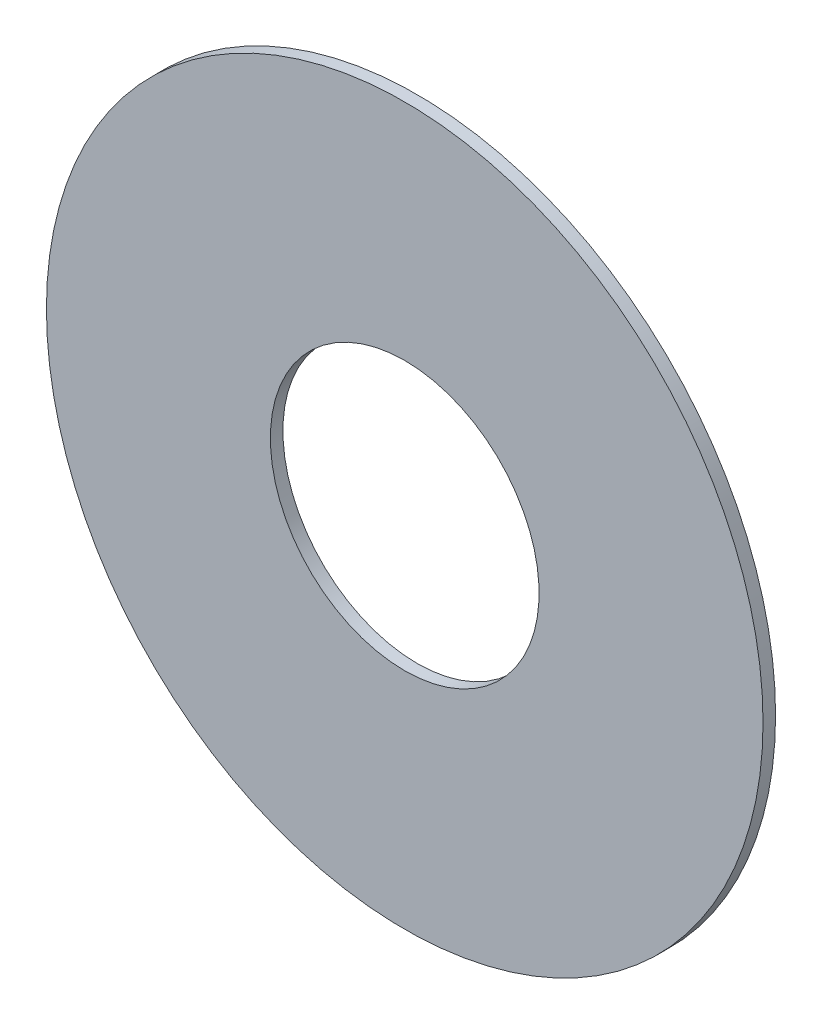
ISO-10303-21;
HEADER;
FILE_DESCRIPTION(('STEP AP214'),'2;1');
FILE_NAME('part.step','',(''),(''),'','','');
FILE_SCHEMA(('AUTOMOTIVE_DESIGN { 1 0 10303 214 1 1 1 1 }'));
ENDSEC;
DATA;
#1=APPLICATION_CONTEXT('core data for automotive mechanical design processes');
#2=APPLICATION_PROTOCOL_DEFINITION('international standard','automotive_design',2000,#1);
#3=PRODUCT_CONTEXT('',#1,'mechanical');
#4=PRODUCT('Part','Part','',(#3));
#5=PRODUCT_RELATED_PRODUCT_CATEGORY('part','',(#4));
#6=PRODUCT_DEFINITION_FORMATION('','',#4);
#7=PRODUCT_DEFINITION_CONTEXT('part definition',#1,'design');
#8=PRODUCT_DEFINITION('design','',#6,#7);
#9=PRODUCT_DEFINITION_SHAPE('','',#8);
#10=(LENGTH_UNIT() NAMED_UNIT(*) SI_UNIT(.MILLI.,.METRE.));
#11=(NAMED_UNIT(*) PLANE_ANGLE_UNIT() SI_UNIT($,.RADIAN.));
#12=(NAMED_UNIT(*) SI_UNIT($,.STERADIAN.) SOLID_ANGLE_UNIT());
#13=UNCERTAINTY_MEASURE_WITH_UNIT(LENGTH_MEASURE(1.E-05),#10,'distance_accuracy_value','');
#14=(GEOMETRIC_REPRESENTATION_CONTEXT(3) GLOBAL_UNCERTAINTY_ASSIGNED_CONTEXT((#13)) GLOBAL_UNIT_ASSIGNED_CONTEXT((#10,
#11,#12)) REPRESENTATION_CONTEXT('',''));
#15=CARTESIAN_POINT('',(0.,0.,0.));
#16=DIRECTION('',(0.,0.,1.));
#17=DIRECTION('',(1.,0.,0.));
#18=AXIS2_PLACEMENT_3D('',#15,#16,#17);
#19=CARTESIAN_POINT('',(148.844,-73.152,-0.045));
#20=DIRECTION('',(0.,0.,-1.));
#21=DIRECTION('',(0.,-1.,0.));
#22=AXIS2_PLACEMENT_3D('',#19,#20,#21);
#23=CYLINDRICAL_SURFACE('',#22,0.375);
#24=CARTESIAN_POINT('',(148.844,-73.152,-0.035));
#25=DIRECTION('',(0.,0.,-1.));
#26=DIRECTION('',(0.,-1.,0.));
#27=AXIS2_PLACEMENT_3D('',#24,#25,#26);
#28=CIRCLE('',#27,0.375);
#29=CARTESIAN_POINT('',(148.844,-73.527,-0.035));
#30=VERTEX_POINT('',#29);
#31=EDGE_CURVE('E25',#30,#30,#28,.T.);
#32=ORIENTED_EDGE('',*,*,#31,.T.);
#33=DIRECTION('',(0.,0.,1.));
#34=VECTOR('',#33,1.);
#35=CARTESIAN_POINT('',(148.844,-73.527,-0.045));
#36=LINE('',#35,#34);
#37=CARTESIAN_POINT('',(148.844,-73.527,0.));
#38=VERTEX_POINT('',#37);
#39=EDGE_CURVE('E11',#30,#38,#36,.T.);
#40=ORIENTED_EDGE('',*,*,#39,.T.);
#41=CARTESIAN_POINT('',(148.844,-73.152,0.));
#42=DIRECTION('',(0.,0.,-1.));
#43=DIRECTION('',(0.,-1.,0.));
#44=AXIS2_PLACEMENT_3D('',#41,#42,#43);
#45=CIRCLE('',#44,0.375);
#46=EDGE_CURVE('E69',#38,#38,#45,.T.);
#47=ORIENTED_EDGE('',*,*,#46,.F.);
#48=ORIENTED_EDGE('',*,*,#39,.F.);
#49=EDGE_LOOP('',(#32,#40,#47,#48));
#50=FACE_BOUND('',#49,.T.);
#51=ADVANCED_FACE('F17',(#50),#23,.F.);
#52=CARTESIAN_POINT('',(148.844,-73.152,-0.035));
#53=DIRECTION('',(0.,0.,1.));
#54=DIRECTION('',(1.,0.,0.));
#55=AXIS2_PLACEMENT_3D('',#52,#53,#54);
#56=PLANE('',#55);
#57=ORIENTED_EDGE('',*,*,#31,.F.);
#58=EDGE_LOOP('',(#57));
#59=FACE_BOUND('',#58,.T.);
#60=CARTESIAN_POINT('',(148.844,-73.152,-0.035));
#61=DIRECTION('',(0.,0.,1.));
#62=DIRECTION('',(1.,0.,0.));
#63=AXIS2_PLACEMENT_3D('',#60,#61,#62);
#64=CIRCLE('',#63,1.);
#65=CARTESIAN_POINT('',(149.844,-73.152,-0.035));
#66=VERTEX_POINT('',#65);
#67=EDGE_CURVE('E56',#66,#66,#64,.T.);
#68=ORIENTED_EDGE('',*,*,#67,.F.);
#69=EDGE_LOOP('',(#68));
#70=FACE_BOUND('',#69,.T.);
#71=ADVANCED_FACE('F76',(#59,#70),#56,.F.);
#72=CARTESIAN_POINT('',(148.844,-73.152,0.));
#73=DIRECTION('',(0.,0.,1.));
#74=DIRECTION('',(1.,0.,0.));
#75=AXIS2_PLACEMENT_3D('',#72,#73,#74);
#76=PLANE('',#75);
#77=ORIENTED_EDGE('',*,*,#46,.T.);
#78=EDGE_LOOP('',(#77));
#79=FACE_BOUND('',#78,.T.);
#80=CARTESIAN_POINT('',(148.844,-73.152,0.));
#81=DIRECTION('',(0.,0.,1.));
#82=DIRECTION('',(1.,0.,0.));
#83=AXIS2_PLACEMENT_3D('',#80,#81,#82);
#84=CIRCLE('',#83,1.);
#85=CARTESIAN_POINT('',(149.844,-73.152,0.));
#86=VERTEX_POINT('',#85);
#87=EDGE_CURVE('E54',#86,#86,#84,.T.);
#88=ORIENTED_EDGE('',*,*,#87,.T.);
#89=EDGE_LOOP('',(#88));
#90=FACE_BOUND('',#89,.T.);
#91=ADVANCED_FACE('F60',(#79,#90),#76,.T.);
#92=CARTESIAN_POINT('',(148.844,-73.152,-0.035));
#93=DIRECTION('',(0.,0.,1.));
#94=DIRECTION('',(1.,0.,0.));
#95=AXIS2_PLACEMENT_3D('',#92,#93,#94);
#96=CYLINDRICAL_SURFACE('',#95,1.);
#97=ORIENTED_EDGE('',*,*,#87,.F.);
#98=DIRECTION('',(0.,0.,1.));
#99=VECTOR('',#98,1.);
#100=CARTESIAN_POINT('',(149.844,-73.152,-0.035));
#101=LINE('',#100,#99);
#102=EDGE_CURVE('E51',#66,#86,#101,.T.);
#103=ORIENTED_EDGE('',*,*,#102,.F.);
#104=ORIENTED_EDGE('',*,*,#67,.T.);
#105=ORIENTED_EDGE('',*,*,#102,.T.);
#106=EDGE_LOOP('',(#97,#103,#104,#105));
#107=FACE_BOUND('',#106,.T.);
#108=ADVANCED_FACE('F53',(#107),#96,.T.);
#109=CLOSED_SHELL('',(#51,#71,#91,#108));
#110=MANIFOLD_SOLID_BREP('B1',#109);
#111=ADVANCED_BREP_SHAPE_REPRESENTATION('',(#18,#110),#14);
#112=SHAPE_DEFINITION_REPRESENTATION(#9,#111);
ENDSEC;
END-ISO-10303-21;
